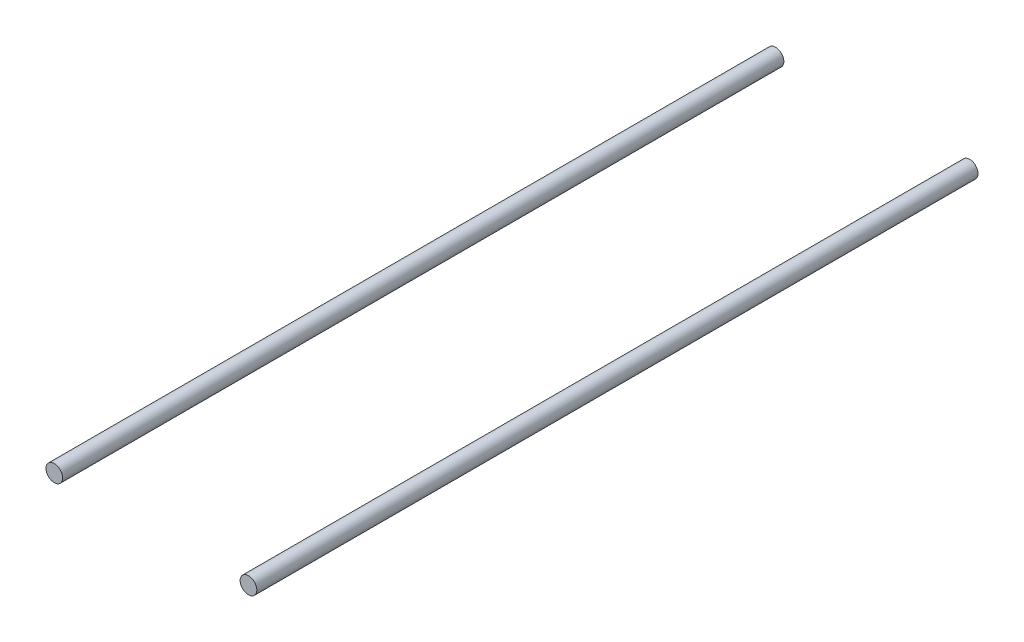
ISO-10303-21;
HEADER;
FILE_DESCRIPTION(('STEP AP214'),'2;1');
FILE_NAME('part.step','',(''),(''),'','','');
FILE_SCHEMA(('AUTOMOTIVE_DESIGN { 1 0 10303 214 1 1 1 1 }'));
ENDSEC;
DATA;
#1=APPLICATION_CONTEXT('core data for automotive mechanical design processes');
#2=APPLICATION_PROTOCOL_DEFINITION('international standard','automotive_design',2000,#1);
#3=PRODUCT_CONTEXT('',#1,'mechanical');
#4=PRODUCT('Part','Part','',(#3));
#5=PRODUCT_RELATED_PRODUCT_CATEGORY('part','',(#4));
#6=PRODUCT_DEFINITION_FORMATION('','',#4);
#7=PRODUCT_DEFINITION_CONTEXT('part definition',#1,'design');
#8=PRODUCT_DEFINITION('design','',#6,#7);
#9=PRODUCT_DEFINITION_SHAPE('','',#8);
#10=(LENGTH_UNIT() NAMED_UNIT(*) SI_UNIT(.MILLI.,.METRE.));
#11=(NAMED_UNIT(*) PLANE_ANGLE_UNIT() SI_UNIT($,.RADIAN.));
#12=(NAMED_UNIT(*) SI_UNIT($,.STERADIAN.) SOLID_ANGLE_UNIT());
#13=UNCERTAINTY_MEASURE_WITH_UNIT(LENGTH_MEASURE(1.E-05),#10,'distance_accuracy_value','');
#14=(GEOMETRIC_REPRESENTATION_CONTEXT(3) GLOBAL_UNCERTAINTY_ASSIGNED_CONTEXT((#13)) GLOBAL_UNIT_ASSIGNED_CONTEXT((#10,
#11,#12)) REPRESENTATION_CONTEXT('',''));
#15=CARTESIAN_POINT('',(0.,0.,0.));
#16=DIRECTION('',(0.,0.,1.));
#17=DIRECTION('',(1.,0.,0.));
#18=AXIS2_PLACEMENT_3D('',#15,#16,#17);
#19=CARTESIAN_POINT('',(0.,670.,130.));
#20=DIRECTION('',(0.,0.,-1.));
#21=DIRECTION('',(-1.,0.,0.));
#22=AXIS2_PLACEMENT_3D('',#19,#20,#21);
#23=CYLINDRICAL_SURFACE('',#22,3.);
#24=CARTESIAN_POINT('',(0.,670.,130.));
#25=DIRECTION('',(0.,0.,1.));
#26=DIRECTION('',(1.,0.,0.));
#27=AXIS2_PLACEMENT_3D('',#24,#25,#26);
#28=CIRCLE('',#27,3.);
#29=CARTESIAN_POINT('',(3.,670.,130.));
#30=VERTEX_POINT('',#29);
#31=EDGE_CURVE('E58',#30,#30,#28,.T.);
#32=ORIENTED_EDGE('',*,*,#31,.F.);
#33=EDGE_LOOP('',(#32));
#34=FACE_BOUND('',#33,.T.);
#35=CARTESIAN_POINT('',(0.,670.,-130.));
#36=DIRECTION('',(0.,0.,1.));
#37=DIRECTION('',(1.,0.,0.));
#38=AXIS2_PLACEMENT_3D('',#35,#36,#37);
#39=CIRCLE('',#38,3.);
#40=CARTESIAN_POINT('',(3.,670.,-130.));
#41=VERTEX_POINT('',#40);
#42=EDGE_CURVE('E11',#41,#41,#39,.T.);
#43=ORIENTED_EDGE('',*,*,#42,.T.);
#44=EDGE_LOOP('',(#43));
#45=FACE_BOUND('',#44,.T.);
#46=ADVANCED_FACE('F51',(#34,#45),#23,.T.);
#47=CARTESIAN_POINT('',(0.,670.,130.));
#48=DIRECTION('',(0.,0.,1.));
#49=DIRECTION('',(1.,0.,0.));
#50=AXIS2_PLACEMENT_3D('',#47,#48,#49);
#51=PLANE('',#50);
#52=ORIENTED_EDGE('',*,*,#31,.T.);
#53=EDGE_LOOP('',(#52));
#54=FACE_BOUND('',#53,.T.);
#55=ADVANCED_FACE('F64',(#54),#51,.T.);
#56=CARTESIAN_POINT('',(0.,670.,-130.));
#57=DIRECTION('',(0.,0.,1.));
#58=DIRECTION('',(1.,0.,0.));
#59=AXIS2_PLACEMENT_3D('',#56,#57,#58);
#60=PLANE('',#59);
#61=ORIENTED_EDGE('',*,*,#42,.F.);
#62=EDGE_LOOP('',(#61));
#63=FACE_BOUND('',#62,.T.);
#64=ADVANCED_FACE('F53',(#63),#60,.F.);
#65=CLOSED_SHELL('',(#46,#55,#64));
#66=MANIFOLD_SOLID_BREP('B2',#65);
#67=CARTESIAN_POINT('',(70.,670.,130.));
#68=DIRECTION('',(0.,0.,-1.));
#69=DIRECTION('',(-1.,0.,0.));
#70=AXIS2_PLACEMENT_3D('',#67,#68,#69);
#71=CYLINDRICAL_SURFACE('',#70,3.00000000000001);
#72=CARTESIAN_POINT('',(70.,670.,130.));
#73=DIRECTION('',(0.,0.,1.));
#74=DIRECTION('',(1.,0.,0.));
#75=AXIS2_PLACEMENT_3D('',#72,#73,#74);
#76=CIRCLE('',#75,3.00000000000001);
#77=CARTESIAN_POINT('',(73.,670.,130.));
#78=VERTEX_POINT('',#77);
#79=EDGE_CURVE('E50',#78,#78,#76,.T.);
#80=ORIENTED_EDGE('',*,*,#79,.F.);
#81=EDGE_LOOP('',(#80));
#82=FACE_BOUND('',#81,.T.);
#83=CARTESIAN_POINT('',(70.,670.,-130.));
#84=DIRECTION('',(0.,0.,1.));
#85=DIRECTION('',(1.,0.,0.));
#86=AXIS2_PLACEMENT_3D('',#83,#84,#85);
#87=CIRCLE('',#86,3.00000000000001);
#88=CARTESIAN_POINT('',(73.,670.,-130.));
#89=VERTEX_POINT('',#88);
#90=EDGE_CURVE('E99',#89,#89,#87,.T.);
#91=ORIENTED_EDGE('',*,*,#90,.T.);
#92=EDGE_LOOP('',(#91));
#93=FACE_BOUND('',#92,.T.);
#94=ADVANCED_FACE('F92',(#82,#93),#71,.T.);
#95=CARTESIAN_POINT('',(0.,0.,130.));
#96=DIRECTION('',(0.,0.,1.));
#97=DIRECTION('',(1.,0.,0.));
#98=AXIS2_PLACEMENT_3D('',#95,#96,#97);
#99=PLANE('',#98);
#100=ORIENTED_EDGE('',*,*,#79,.T.);
#101=EDGE_LOOP('',(#100));
#102=FACE_BOUND('',#101,.T.);
#103=ADVANCED_FACE('F109',(#102),#99,.T.);
#104=CARTESIAN_POINT('',(0.,0.,-130.));
#105=DIRECTION('',(0.,0.,1.));
#106=DIRECTION('',(1.,0.,0.));
#107=AXIS2_PLACEMENT_3D('',#104,#105,#106);
#108=PLANE('',#107);
#109=ORIENTED_EDGE('',*,*,#90,.F.);
#110=EDGE_LOOP('',(#109));
#111=FACE_BOUND('',#110,.T.);
#112=ADVANCED_FACE('F107',(#111),#108,.F.);
#113=CLOSED_SHELL('',(#94,#103,#112));
#114=MANIFOLD_SOLID_BREP('B6',#113);
#115=ADVANCED_BREP_SHAPE_REPRESENTATION('',(#18,#66,#114),#14);
#116=SHAPE_DEFINITION_REPRESENTATION(#9,#115);
ENDSEC;
END-ISO-10303-21;
